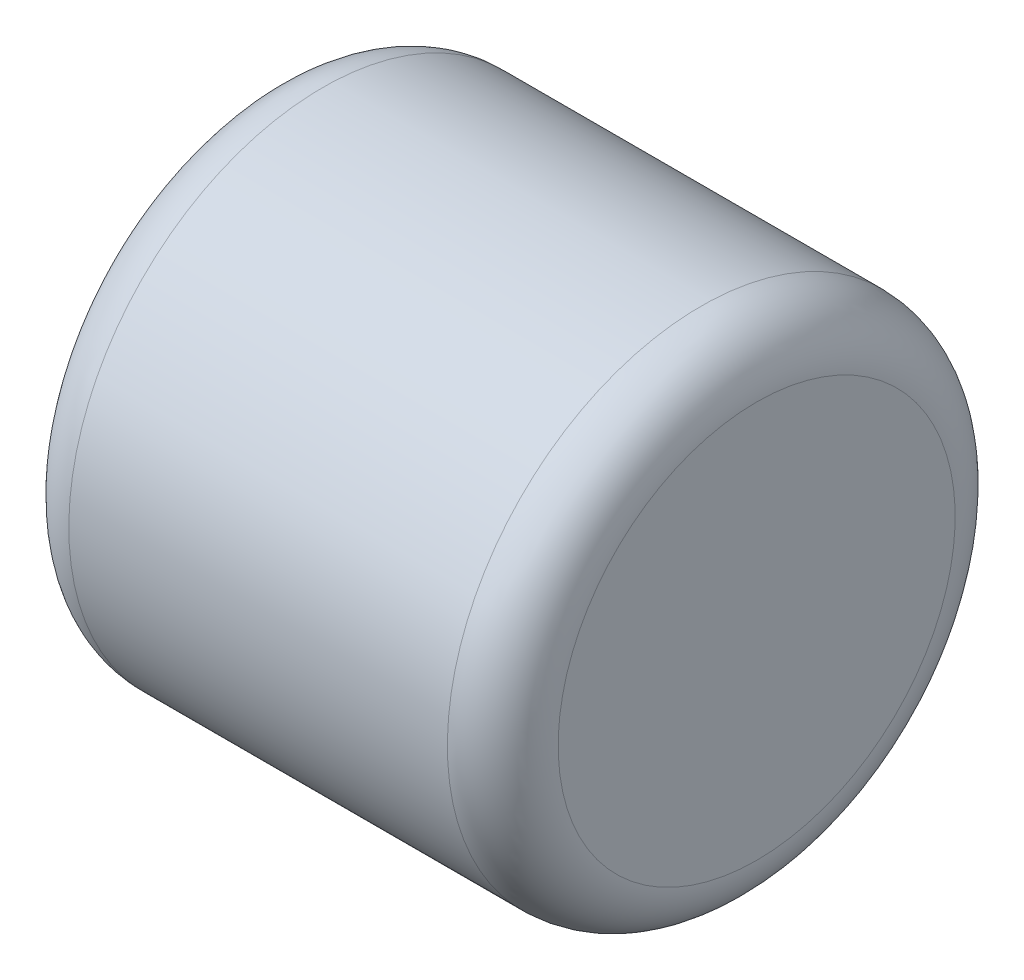
ISO-10303-21;
HEADER;
FILE_DESCRIPTION(('STEP AP214'),'2;1');
FILE_NAME('part.step','',(''),(''),'','','');
FILE_SCHEMA(('AUTOMOTIVE_DESIGN { 1 0 10303 214 1 1 1 1 }'));
ENDSEC;
DATA;
#1=APPLICATION_CONTEXT('core data for automotive mechanical design processes');
#2=APPLICATION_PROTOCOL_DEFINITION('international standard','automotive_design',2000,#1);
#3=PRODUCT_CONTEXT('',#1,'mechanical');
#4=PRODUCT('Part','Part','',(#3));
#5=PRODUCT_RELATED_PRODUCT_CATEGORY('part','',(#4));
#6=PRODUCT_DEFINITION_FORMATION('','',#4);
#7=PRODUCT_DEFINITION_CONTEXT('part definition',#1,'design');
#8=PRODUCT_DEFINITION('design','',#6,#7);
#9=PRODUCT_DEFINITION_SHAPE('','',#8);
#10=(LENGTH_UNIT() NAMED_UNIT(*) SI_UNIT(.MILLI.,.METRE.));
#11=(NAMED_UNIT(*) PLANE_ANGLE_UNIT() SI_UNIT($,.RADIAN.));
#12=(NAMED_UNIT(*) SI_UNIT($,.STERADIAN.) SOLID_ANGLE_UNIT());
#13=UNCERTAINTY_MEASURE_WITH_UNIT(LENGTH_MEASURE(1.E-05),#10,'distance_accuracy_value','');
#14=(GEOMETRIC_REPRESENTATION_CONTEXT(3) GLOBAL_UNCERTAINTY_ASSIGNED_CONTEXT((#13)) GLOBAL_UNIT_ASSIGNED_CONTEXT((#10,
#11,#12)) REPRESENTATION_CONTEXT('',''));
#15=CARTESIAN_POINT('',(0.,0.,0.));
#16=DIRECTION('',(0.,0.,1.));
#17=DIRECTION('',(1.,0.,0.));
#18=AXIS2_PLACEMENT_3D('',#15,#16,#17);
#19=CARTESIAN_POINT('',(8.15,-1.075,-12.4));
#20=DIRECTION('',(1.,0.,0.));
#21=DIRECTION('',(0.,1.,0.));
#22=AXIS2_PLACEMENT_3D('',#19,#20,#21);
#23=PLANE('',#22);
#24=CARTESIAN_POINT('',(8.15,0.,-12.4));
#25=DIRECTION('',(-1.,0.,0.));
#26=DIRECTION('',(0.,-1.,0.));
#27=AXIS2_PLACEMENT_3D('',#24,#25,#26);
#28=CIRCLE('',#27,2.15);
#29=CARTESIAN_POINT('',(8.15,-2.15,-12.4));
#30=VERTEX_POINT('',#29);
#31=EDGE_CURVE('E60',#30,#30,#28,.T.);
#32=ORIENTED_EDGE('',*,*,#31,.F.);
#33=EDGE_LOOP('',(#32));
#34=FACE_BOUND('',#33,.T.);
#35=ADVANCED_FACE('F13',(#34),#23,.T.);
#36=CARTESIAN_POINT('',(2.85,-1.075,-12.4));
#37=DIRECTION('',(-1.,0.,0.));
#38=DIRECTION('',(0.,-1.,0.));
#39=AXIS2_PLACEMENT_3D('',#36,#37,#38);
#40=PLANE('',#39);
#41=CARTESIAN_POINT('',(2.85,0.,-12.4));
#42=DIRECTION('',(1.,0.,0.));
#43=DIRECTION('',(0.,-1.,0.));
#44=AXIS2_PLACEMENT_3D('',#41,#42,#43);
#45=CIRCLE('',#44,2.15);
#46=CARTESIAN_POINT('',(2.85,-2.15,-12.4));
#47=VERTEX_POINT('',#46);
#48=EDGE_CURVE('E28',#47,#47,#45,.T.);
#49=ORIENTED_EDGE('',*,*,#48,.F.);
#50=EDGE_LOOP('',(#49));
#51=FACE_BOUND('',#50,.T.);
#52=ADVANCED_FACE('F73',(#51),#40,.T.);
#53=CARTESIAN_POINT('',(7.55,0.,-12.4));
#54=DIRECTION('',(-1.,0.,0.));
#55=DIRECTION('',(0.,0.,-1.));
#56=AXIS2_PLACEMENT_3D('',#53,#54,#55);
#57=TOROIDAL_SURFACE('',#56,2.15,0.600000000000001);
#58=ORIENTED_EDGE('',*,*,#31,.T.);
#59=EDGE_LOOP('',(#58));
#60=FACE_BOUND('',#59,.T.);
#61=CARTESIAN_POINT('',(7.55,0.,-12.4));
#62=DIRECTION('',(-1.,0.,0.));
#63=DIRECTION('',(0.,-1.,0.));
#64=AXIS2_PLACEMENT_3D('',#61,#62,#63);
#65=CIRCLE('',#64,2.75);
#66=CARTESIAN_POINT('',(7.55,-2.75,-12.4));
#67=VERTEX_POINT('',#66);
#68=EDGE_CURVE('E23',#67,#67,#65,.T.);
#69=ORIENTED_EDGE('',*,*,#68,.F.);
#70=EDGE_LOOP('',(#69));
#71=FACE_BOUND('',#70,.T.);
#72=ADVANCED_FACE('F41',(#60,#71),#57,.T.);
#73=CARTESIAN_POINT('',(3.45,0.,-12.4));
#74=DIRECTION('',(-1.,0.,0.));
#75=DIRECTION('',(0.,0.,-1.));
#76=AXIS2_PLACEMENT_3D('',#73,#74,#75);
#77=TOROIDAL_SURFACE('',#76,2.15,0.6);
#78=CARTESIAN_POINT('',(3.45,0.,-12.4));
#79=DIRECTION('',(-1.,0.,0.));
#80=DIRECTION('',(0.,-1.,0.));
#81=AXIS2_PLACEMENT_3D('',#78,#79,#80);
#82=CIRCLE('',#81,2.75);
#83=CARTESIAN_POINT('',(3.45,-2.75,-12.4));
#84=VERTEX_POINT('',#83);
#85=EDGE_CURVE('E9',#84,#84,#82,.F.);
#86=ORIENTED_EDGE('',*,*,#85,.F.);
#87=EDGE_LOOP('',(#86));
#88=FACE_BOUND('',#87,.T.);
#89=ORIENTED_EDGE('',*,*,#48,.T.);
#90=EDGE_LOOP('',(#89));
#91=FACE_BOUND('',#90,.T.);
#92=ADVANCED_FACE('F36',(#88,#91),#77,.T.);
#93=CARTESIAN_POINT('',(5.5,0.,-12.4));
#94=DIRECTION('',(-1.,0.,0.));
#95=DIRECTION('',(0.,-1.,0.));
#96=AXIS2_PLACEMENT_3D('',#93,#94,#95);
#97=CYLINDRICAL_SURFACE('',#96,2.75);
#98=ORIENTED_EDGE('',*,*,#68,.T.);
#99=EDGE_LOOP('',(#98));
#100=FACE_BOUND('',#99,.T.);
#101=ORIENTED_EDGE('',*,*,#85,.T.);
#102=EDGE_LOOP('',(#101));
#103=FACE_BOUND('',#102,.T.);
#104=ADVANCED_FACE('F40',(#100,#103),#97,.T.);
#105=CLOSED_SHELL('',(#35,#52,#72,#92,#104));
#106=MANIFOLD_SOLID_BREP('B1',#105);
#107=ADVANCED_BREP_SHAPE_REPRESENTATION('',(#18,#106),#14);
#108=SHAPE_DEFINITION_REPRESENTATION(#9,#107);
ENDSEC;
END-ISO-10303-21;
